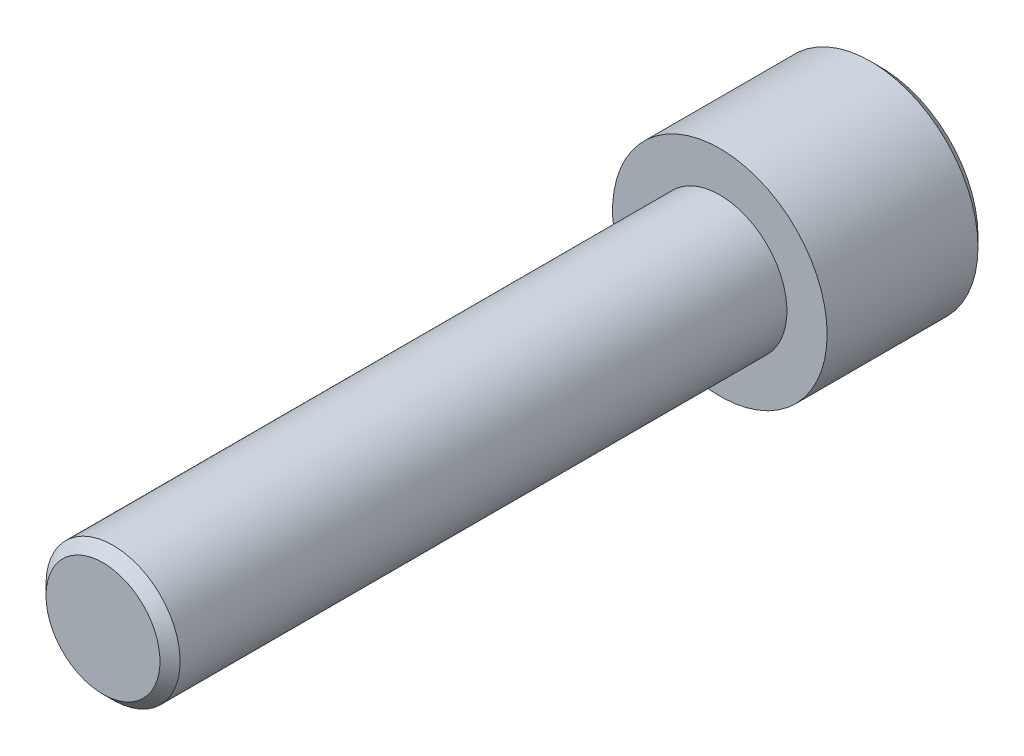
ISO-10303-21;
HEADER;
FILE_DESCRIPTION(('STEP AP214'),'2;1');
FILE_NAME('part.step','',(''),(''),'','','');
FILE_SCHEMA(('AUTOMOTIVE_DESIGN { 1 0 10303 214 1 1 1 1 }'));
ENDSEC;
DATA;
#1=APPLICATION_CONTEXT('core data for automotive mechanical design processes');
#2=APPLICATION_PROTOCOL_DEFINITION('international standard','automotive_design',2000,#1);
#3=PRODUCT_CONTEXT('',#1,'mechanical');
#4=PRODUCT('Part','Part','',(#3));
#5=PRODUCT_RELATED_PRODUCT_CATEGORY('part','',(#4));
#6=PRODUCT_DEFINITION_FORMATION('','',#4);
#7=PRODUCT_DEFINITION_CONTEXT('part definition',#1,'design');
#8=PRODUCT_DEFINITION('design','',#6,#7);
#9=PRODUCT_DEFINITION_SHAPE('','',#8);
#10=(LENGTH_UNIT() NAMED_UNIT(*) SI_UNIT(.MILLI.,.METRE.));
#11=(NAMED_UNIT(*) PLANE_ANGLE_UNIT() SI_UNIT($,.RADIAN.));
#12=(NAMED_UNIT(*) SI_UNIT($,.STERADIAN.) SOLID_ANGLE_UNIT());
#13=UNCERTAINTY_MEASURE_WITH_UNIT(LENGTH_MEASURE(1.E-05),#10,'distance_accuracy_value','');
#14=(GEOMETRIC_REPRESENTATION_CONTEXT(3) GLOBAL_UNCERTAINTY_ASSIGNED_CONTEXT((#13)) GLOBAL_UNIT_ASSIGNED_CONTEXT((#10,
#11,#12)) REPRESENTATION_CONTEXT('',''));
#15=CARTESIAN_POINT('',(0.,0.,0.));
#16=DIRECTION('',(0.,0.,1.));
#17=DIRECTION('',(1.,0.,0.));
#18=AXIS2_PLACEMENT_3D('',#15,#16,#17);
#19=CARTESIAN_POINT('',(-9.33720002000013,-3.47499432,1.7));
#20=DIRECTION('',(0.,0.,1.));
#21=DIRECTION('',(1.,0.,0.));
#22=AXIS2_PLACEMENT_3D('',#19,#20,#21);
#23=PLANE('',#22);
#24=CARTESIAN_POINT('',(-9.33720002000013,-3.47499432,1.69999999997117));
#25=DIRECTION('',(0.,0.,1.));
#26=DIRECTION('',(1.,0.,0.));
#27=AXIS2_PLACEMENT_3D('',#24,#25,#26);
#28=CIRCLE('',#27,0.725000000202675);
#29=CARTESIAN_POINT('',(-8.61220001979746,-3.47499432,1.69999999997117));
#30=VERTEX_POINT('',#29);
#31=EDGE_CURVE('E18',#30,#30,#28,.T.);
#32=ORIENTED_EDGE('',*,*,#31,.F.);
#33=EDGE_LOOP('',(#32));
#34=FACE_BOUND('',#33,.T.);
#35=ADVANCED_FACE('F15',(#34),#23,.F.);
#36=CARTESIAN_POINT('',(-9.33720002000013,-3.47499432,1.77499999995234));
#37=DIRECTION('',(0.,0.,1.));
#38=DIRECTION('',(1.,0.,0.));
#39=AXIS2_PLACEMENT_3D('',#36,#37,#38);
#40=CONICAL_SURFACE('',#39,0.800000000013318,0.78539816226058);
#41=CARTESIAN_POINT('',(-9.33720002000013,-3.47499432,1.775));
#42=DIRECTION('',(0.,0.,1.));
#43=DIRECTION('',(1.,0.,0.));
#44=AXIS2_PLACEMENT_3D('',#41,#42,#43);
#45=CIRCLE('',#44,0.8);
#46=CARTESIAN_POINT('',(-8.53720002000013,-3.47499432,1.775));
#47=VERTEX_POINT('',#46);
#48=EDGE_CURVE('E31',#47,#47,#45,.T.);
#49=ORIENTED_EDGE('',*,*,#48,.F.);
#50=EDGE_LOOP('',(#49));
#51=FACE_BOUND('',#50,.T.);
#52=ORIENTED_EDGE('',*,*,#31,.T.);
#53=EDGE_LOOP('',(#52));
#54=FACE_BOUND('',#53,.T.);
#55=ADVANCED_FACE('F43',(#51,#54),#40,.T.);
#56=CARTESIAN_POINT('',(-9.33720002000013,-3.47499432,7.5));
#57=DIRECTION('',(0.,0.,1.));
#58=DIRECTION('',(1.,0.,0.));
#59=AXIS2_PLACEMENT_3D('',#56,#57,#58);
#60=PLANE('',#59);
#61=CARTESIAN_POINT('',(-9.33720002000013,-3.47499432,7.49999999999318));
#62=DIRECTION('',(0.,0.,-1.));
#63=DIRECTION('',(-1.,0.,0.));
#64=AXIS2_PLACEMENT_3D('',#61,#62,#63);
#65=CIRCLE('',#64,0.425000000020242);
#66=CARTESIAN_POINT('',(-9.76220002002037,-3.47499432,7.49999999999318));
#67=VERTEX_POINT('',#66);
#68=EDGE_CURVE('E33',#67,#67,#65,.T.);
#69=ORIENTED_EDGE('',*,*,#68,.F.);
#70=EDGE_LOOP('',(#69));
#71=FACE_BOUND('',#70,.T.);
#72=ADVANCED_FACE('F50',(#71),#60,.T.);
#73=CARTESIAN_POINT('',(-9.33720002000013,-3.47499432,1.7));
#74=DIRECTION('',(0.,0.,1.));
#75=DIRECTION('',(1.,0.,0.));
#76=AXIS2_PLACEMENT_3D('',#73,#74,#75);
#77=CYLINDRICAL_SURFACE('',#76,0.8);
#78=CARTESIAN_POINT('',(-9.33720002000013,-3.47499432,2.9));
#79=DIRECTION('',(0.,0.,1.));
#80=DIRECTION('',(1.,0.,0.));
#81=AXIS2_PLACEMENT_3D('',#78,#79,#80);
#82=CIRCLE('',#81,0.8);
#83=CARTESIAN_POINT('',(-8.53720002000013,-3.47499432,2.9));
#84=VERTEX_POINT('',#83);
#85=EDGE_CURVE('E27',#84,#84,#82,.T.);
#86=ORIENTED_EDGE('',*,*,#85,.F.);
#87=EDGE_LOOP('',(#86));
#88=FACE_BOUND('',#87,.T.);
#89=ORIENTED_EDGE('',*,*,#48,.T.);
#90=EDGE_LOOP('',(#89));
#91=FACE_BOUND('',#90,.T.);
#92=ADVANCED_FACE('F66',(#88,#91),#77,.T.);
#93=CARTESIAN_POINT('',(-9.33720002000013,-3.47499432,7.42499999995516));
#94=DIRECTION('',(0.,0.,-1.));
#95=DIRECTION('',(-1.,0.,0.));
#96=AXIS2_PLACEMENT_3D('',#93,#94,#95);
#97=CONICAL_SURFACE('',#96,0.499999999944573,0.785398162639542);
#98=ORIENTED_EDGE('',*,*,#68,.T.);
#99=EDGE_LOOP('',(#98));
#100=FACE_BOUND('',#99,.T.);
#101=CARTESIAN_POINT('',(-9.33720002000013,-3.47499432,7.425));
#102=DIRECTION('',(0.,0.,-1.));
#103=DIRECTION('',(-1.,0.,0.));
#104=AXIS2_PLACEMENT_3D('',#101,#102,#103);
#105=CIRCLE('',#104,0.5);
#106=CARTESIAN_POINT('',(-9.83720002000013,-3.47499432,7.425));
#107=VERTEX_POINT('',#106);
#108=EDGE_CURVE('E22',#107,#107,#105,.T.);
#109=ORIENTED_EDGE('',*,*,#108,.F.);
#110=EDGE_LOOP('',(#109));
#111=FACE_BOUND('',#110,.T.);
#112=ADVANCED_FACE('F60',(#100,#111),#97,.T.);
#113=CARTESIAN_POINT('',(-9.33720002000013,-3.47499432,2.9));
#114=DIRECTION('',(0.,0.,1.));
#115=DIRECTION('',(1.,0.,0.));
#116=AXIS2_PLACEMENT_3D('',#113,#114,#115);
#117=PLANE('',#116);
#118=CARTESIAN_POINT('',(-9.33720002000013,-3.47499432,2.9));
#119=DIRECTION('',(0.,0.,-1.));
#120=DIRECTION('',(-1.,0.,0.));
#121=AXIS2_PLACEMENT_3D('',#118,#119,#120);
#122=CIRCLE('',#121,0.5);
#123=CARTESIAN_POINT('',(-9.83720002000013,-3.47499432,2.9));
#124=VERTEX_POINT('',#123);
#125=EDGE_CURVE('E10',#124,#124,#122,.F.);
#126=ORIENTED_EDGE('',*,*,#125,.F.);
#127=EDGE_LOOP('',(#126));
#128=FACE_BOUND('',#127,.T.);
#129=ORIENTED_EDGE('',*,*,#85,.T.);
#130=EDGE_LOOP('',(#129));
#131=FACE_BOUND('',#130,.T.);
#132=ADVANCED_FACE('F54',(#128,#131),#117,.T.);
#133=CARTESIAN_POINT('',(-9.33720002000013,-3.47499432,7.5));
#134=DIRECTION('',(0.,0.,-1.));
#135=DIRECTION('',(-1.,0.,0.));
#136=AXIS2_PLACEMENT_3D('',#133,#134,#135);
#137=CYLINDRICAL_SURFACE('',#136,0.5);
#138=ORIENTED_EDGE('',*,*,#108,.T.);
#139=EDGE_LOOP('',(#138));
#140=FACE_BOUND('',#139,.T.);
#141=ORIENTED_EDGE('',*,*,#125,.T.);
#142=EDGE_LOOP('',(#141));
#143=FACE_BOUND('',#142,.T.);
#144=ADVANCED_FACE('F52',(#140,#143),#137,.T.);
#145=CLOSED_SHELL('',(#35,#55,#72,#92,#112,#132,#144));
#146=MANIFOLD_SOLID_BREP('B1',#145);
#147=ADVANCED_BREP_SHAPE_REPRESENTATION('',(#18,#146),#14);
#148=SHAPE_DEFINITION_REPRESENTATION(#9,#147);
ENDSEC;
END-ISO-10303-21;
